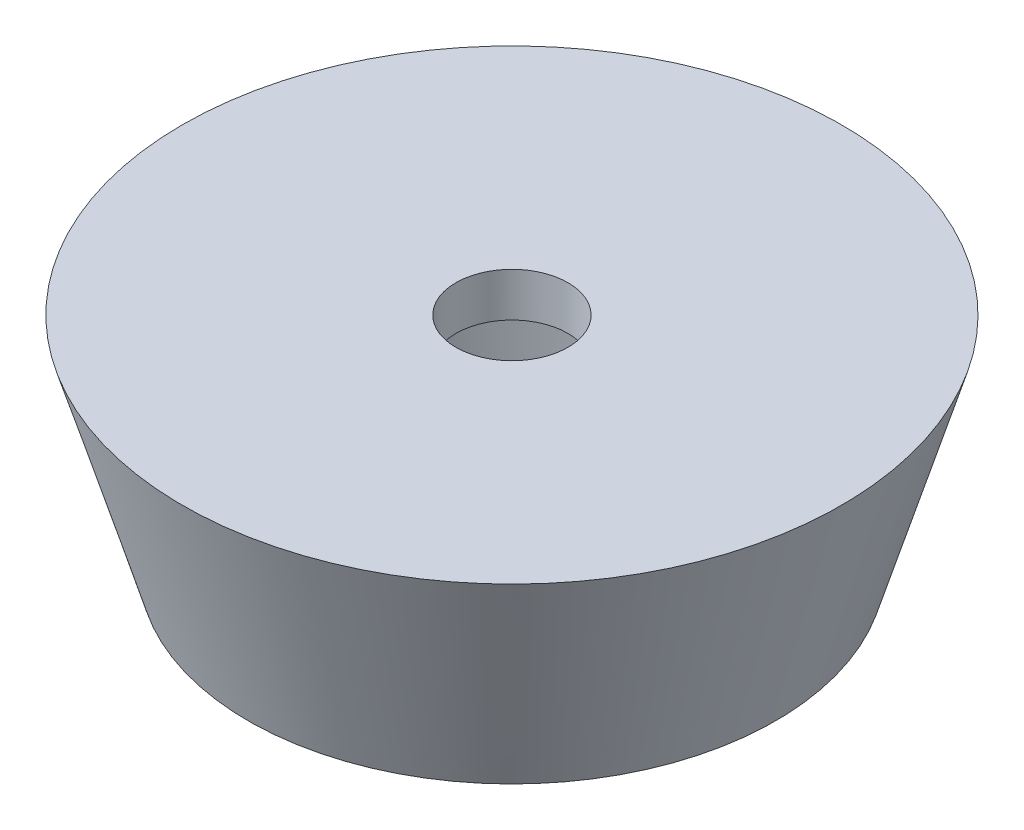
ISO-10303-21;
HEADER;
FILE_DESCRIPTION(('STEP AP214'),'2;1');
FILE_NAME('part.step','',(''),(''),'','','');
FILE_SCHEMA(('AUTOMOTIVE_DESIGN { 1 0 10303 214 1 1 1 1 }'));
ENDSEC;
DATA;
#1=APPLICATION_CONTEXT('core data for automotive mechanical design processes');
#2=APPLICATION_PROTOCOL_DEFINITION('international standard','automotive_design',2000,#1);
#3=PRODUCT_CONTEXT('',#1,'mechanical');
#4=PRODUCT('Part','Part','',(#3));
#5=PRODUCT_RELATED_PRODUCT_CATEGORY('part','',(#4));
#6=PRODUCT_DEFINITION_FORMATION('','',#4);
#7=PRODUCT_DEFINITION_CONTEXT('part definition',#1,'design');
#8=PRODUCT_DEFINITION('design','',#6,#7);
#9=PRODUCT_DEFINITION_SHAPE('','',#8);
#10=(LENGTH_UNIT() NAMED_UNIT(*) SI_UNIT(.MILLI.,.METRE.));
#11=(NAMED_UNIT(*) PLANE_ANGLE_UNIT() SI_UNIT($,.RADIAN.));
#12=(NAMED_UNIT(*) SI_UNIT($,.STERADIAN.) SOLID_ANGLE_UNIT());
#13=UNCERTAINTY_MEASURE_WITH_UNIT(LENGTH_MEASURE(1.E-05),#10,'distance_accuracy_value','');
#14=(GEOMETRIC_REPRESENTATION_CONTEXT(3) GLOBAL_UNCERTAINTY_ASSIGNED_CONTEXT((#13)) GLOBAL_UNIT_ASSIGNED_CONTEXT((#10,
#11,#12)) REPRESENTATION_CONTEXT('',''));
#15=CARTESIAN_POINT('',(0.,0.,0.));
#16=DIRECTION('',(0.,0.,1.));
#17=DIRECTION('',(1.,0.,0.));
#18=AXIS2_PLACEMENT_3D('',#15,#16,#17);
#19=CARTESIAN_POINT('',(0.,-10.,0.));
#20=DIRECTION('',(0.,1.,0.));
#21=DIRECTION('',(-1.,0.,0.));
#22=AXIS2_PLACEMENT_3D('',#19,#20,#21);
#23=CYLINDRICAL_SURFACE('',#22,2.55);
#24=CARTESIAN_POINT('',(0.,0.,0.));
#25=DIRECTION('',(0.,1.,0.));
#26=DIRECTION('',(-1.,0.,0.));
#27=AXIS2_PLACEMENT_3D('',#24,#25,#26);
#28=CIRCLE('',#27,2.55);
#29=CARTESIAN_POINT('',(-2.55,0.,0.));
#30=VERTEX_POINT('',#29);
#31=EDGE_CURVE('E43',#30,#30,#28,.T.);
#32=ORIENTED_EDGE('',*,*,#31,.T.);
#33=EDGE_LOOP('',(#32));
#34=FACE_BOUND('',#33,.T.);
#35=CARTESIAN_POINT('',(0.,-2.,0.));
#36=DIRECTION('',(0.,-1.,0.));
#37=DIRECTION('',(1.,0.,0.));
#38=AXIS2_PLACEMENT_3D('',#35,#36,#37);
#39=CIRCLE('',#38,2.55);
#40=CARTESIAN_POINT('',(2.55,-2.,0.));
#41=VERTEX_POINT('',#40);
#42=EDGE_CURVE('E35',#41,#41,#39,.F.);
#43=ORIENTED_EDGE('',*,*,#42,.F.);
#44=EDGE_LOOP('',(#43));
#45=FACE_BOUND('',#44,.T.);
#46=ADVANCED_FACE('F31',(#34,#45),#23,.F.);
#47=CARTESIAN_POINT('',(-12.0446915822112,0.,0.));
#48=DIRECTION('',(0.,1.,0.));
#49=DIRECTION('',(-1.,0.,0.));
#50=AXIS2_PLACEMENT_3D('',#47,#48,#49);
#51=PLANE('',#50);
#52=ORIENTED_EDGE('',*,*,#31,.F.);
#53=EDGE_LOOP('',(#52));
#54=FACE_BOUND('',#53,.T.);
#55=CARTESIAN_POINT('',(0.,0.,0.));
#56=DIRECTION('',(0.,1.,0.));
#57=DIRECTION('',(-1.,0.,0.));
#58=AXIS2_PLACEMENT_3D('',#55,#56,#57);
#59=CIRCLE('',#58,15.);
#60=CARTESIAN_POINT('',(-15.,0.,0.));
#61=VERTEX_POINT('',#60);
#62=EDGE_CURVE('E10',#61,#61,#59,.T.);
#63=ORIENTED_EDGE('',*,*,#62,.T.);
#64=EDGE_LOOP('',(#63));
#65=FACE_BOUND('',#64,.T.);
#66=ADVANCED_FACE('F33',(#54,#65),#51,.T.);
#67=CARTESIAN_POINT('',(0.,0.,0.));
#68=DIRECTION('',(0.,1.,0.));
#69=DIRECTION('',(-1.,0.,0.));
#70=AXIS2_PLACEMENT_3D('',#67,#68,#69);
#71=CONICAL_SURFACE('',#70,15.,0.291456794477867);
#72=CARTESIAN_POINT('',(0.,-10.,0.));
#73=DIRECTION('',(0.,1.,0.));
#74=DIRECTION('',(-1.,0.,0.));
#75=AXIS2_PLACEMENT_3D('',#72,#73,#74);
#76=CIRCLE('',#75,12.);
#77=CARTESIAN_POINT('',(-12.,-10.,0.));
#78=VERTEX_POINT('',#77);
#79=EDGE_CURVE('E39',#78,#78,#76,.T.);
#80=ORIENTED_EDGE('',*,*,#79,.T.);
#81=EDGE_LOOP('',(#80));
#82=FACE_BOUND('',#81,.T.);
#83=ORIENTED_EDGE('',*,*,#62,.F.);
#84=EDGE_LOOP('',(#83));
#85=FACE_BOUND('',#84,.T.);
#86=ADVANCED_FACE('F66',(#82,#85),#71,.T.);
#87=CARTESIAN_POINT('',(0.,-10.,0.));
#88=DIRECTION('',(0.,-1.,0.));
#89=DIRECTION('',(1.,0.,0.));
#90=AXIS2_PLACEMENT_3D('',#87,#88,#89);
#91=PLANE('',#90);
#92=CARTESIAN_POINT('',(0.,-10.,0.));
#93=DIRECTION('',(0.,-1.,0.));
#94=DIRECTION('',(1.,0.,0.));
#95=AXIS2_PLACEMENT_3D('',#92,#93,#94);
#96=CIRCLE('',#95,10.);
#97=CARTESIAN_POINT('',(10.,-10.,0.));
#98=VERTEX_POINT('',#97);
#99=EDGE_CURVE('E48',#98,#98,#96,.T.);
#100=ORIENTED_EDGE('',*,*,#99,.F.);
#101=EDGE_LOOP('',(#100));
#102=FACE_BOUND('',#101,.T.);
#103=ORIENTED_EDGE('',*,*,#79,.F.);
#104=EDGE_LOOP('',(#103));
#105=FACE_BOUND('',#104,.T.);
#106=ADVANCED_FACE('F72',(#102,#105),#91,.T.);
#107=CARTESIAN_POINT('',(0.,-2.,0.));
#108=DIRECTION('',(0.,-1.,0.));
#109=DIRECTION('',(1.,0.,0.));
#110=AXIS2_PLACEMENT_3D('',#107,#108,#109);
#111=PLANE('',#110);
#112=CARTESIAN_POINT('',(0.,-2.,0.));
#113=DIRECTION('',(0.,-1.,0.));
#114=DIRECTION('',(1.,0.,0.));
#115=AXIS2_PLACEMENT_3D('',#112,#113,#114);
#116=CIRCLE('',#115,10.);
#117=CARTESIAN_POINT('',(10.,-2.,0.));
#118=VERTEX_POINT('',#117);
#119=EDGE_CURVE('E51',#118,#118,#116,.T.);
#120=ORIENTED_EDGE('',*,*,#119,.T.);
#121=EDGE_LOOP('',(#120));
#122=FACE_BOUND('',#121,.T.);
#123=ORIENTED_EDGE('',*,*,#42,.T.);
#124=EDGE_LOOP('',(#123));
#125=FACE_BOUND('',#124,.T.);
#126=ADVANCED_FACE('F58',(#122,#125),#111,.T.);
#127=CARTESIAN_POINT('',(0.,-2.,0.));
#128=DIRECTION('',(0.,-1.,0.));
#129=DIRECTION('',(1.,0.,0.));
#130=AXIS2_PLACEMENT_3D('',#127,#128,#129);
#131=CYLINDRICAL_SURFACE('',#130,10.);
#132=ORIENTED_EDGE('',*,*,#119,.F.);
#133=EDGE_LOOP('',(#132));
#134=FACE_BOUND('',#133,.T.);
#135=ORIENTED_EDGE('',*,*,#99,.T.);
#136=EDGE_LOOP('',(#135));
#137=FACE_BOUND('',#136,.T.);
#138=ADVANCED_FACE('F70',(#134,#137),#131,.F.);
#139=CLOSED_SHELL('',(#46,#66,#86,#106,#126,#138));
#140=MANIFOLD_SOLID_BREP('B2',#139);
#141=ADVANCED_BREP_SHAPE_REPRESENTATION('',(#18,#140),#14);
#142=SHAPE_DEFINITION_REPRESENTATION(#9,#141);
ENDSEC;
END-ISO-10303-21;
